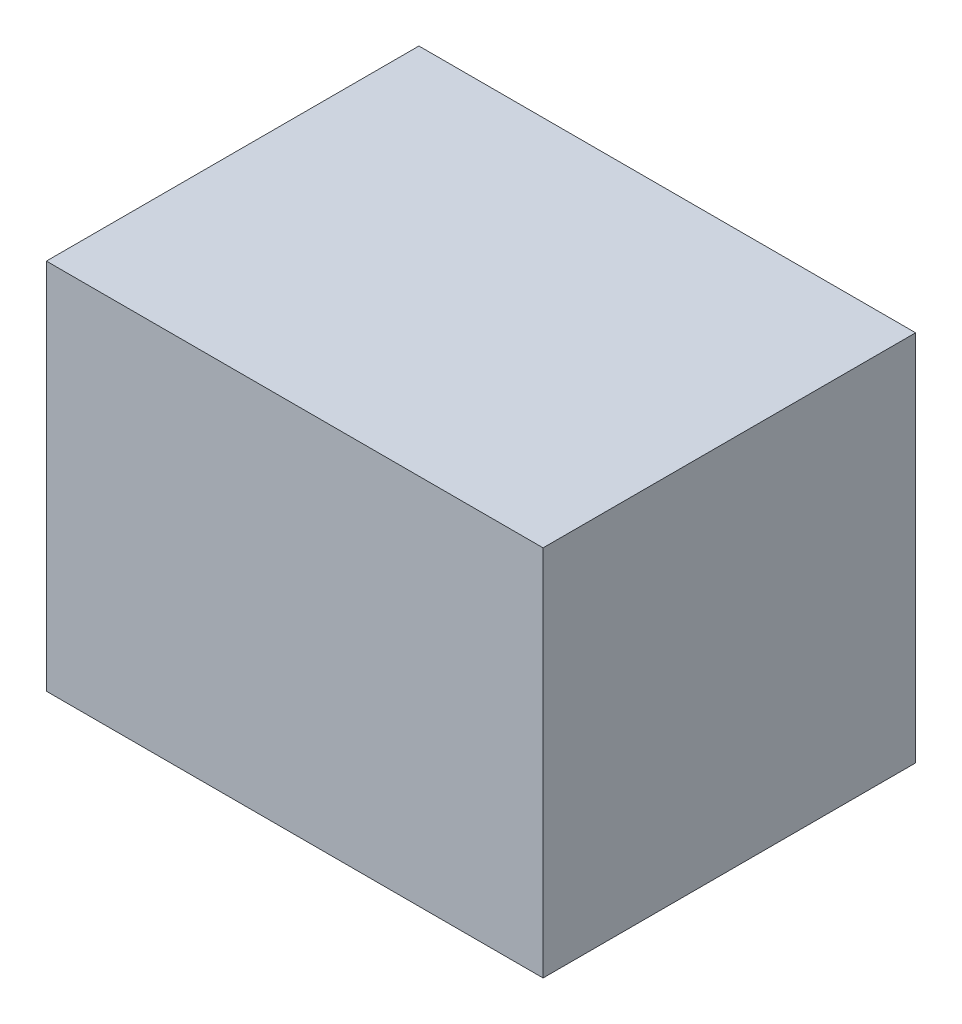
ISO-10303-21;
HEADER;
FILE_DESCRIPTION(('STEP AP214'),'2;1');
FILE_NAME('part.step','',(''),(''),'','','');
FILE_SCHEMA(('AUTOMOTIVE_DESIGN { 1 0 10303 214 1 1 1 1 }'));
ENDSEC;
DATA;
#1=APPLICATION_CONTEXT('core data for automotive mechanical design processes');
#2=APPLICATION_PROTOCOL_DEFINITION('international standard','automotive_design',2000,#1);
#3=PRODUCT_CONTEXT('',#1,'mechanical');
#4=PRODUCT('Part','Part','',(#3));
#5=PRODUCT_RELATED_PRODUCT_CATEGORY('part','',(#4));
#6=PRODUCT_DEFINITION_FORMATION('','',#4);
#7=PRODUCT_DEFINITION_CONTEXT('part definition',#1,'design');
#8=PRODUCT_DEFINITION('design','',#6,#7);
#9=PRODUCT_DEFINITION_SHAPE('','',#8);
#10=(LENGTH_UNIT() NAMED_UNIT(*) SI_UNIT(.MILLI.,.METRE.));
#11=(NAMED_UNIT(*) PLANE_ANGLE_UNIT() SI_UNIT($,.RADIAN.));
#12=(NAMED_UNIT(*) SI_UNIT($,.STERADIAN.) SOLID_ANGLE_UNIT());
#13=UNCERTAINTY_MEASURE_WITH_UNIT(LENGTH_MEASURE(1.E-05),#10,'distance_accuracy_value','');
#14=(GEOMETRIC_REPRESENTATION_CONTEXT(3) GLOBAL_UNCERTAINTY_ASSIGNED_CONTEXT((#13)) GLOBAL_UNIT_ASSIGNED_CONTEXT((#10,
#11,#12)) REPRESENTATION_CONTEXT('',''));
#15=CARTESIAN_POINT('',(0.,0.,0.));
#16=DIRECTION('',(0.,0.,1.));
#17=DIRECTION('',(1.,0.,0.));
#18=AXIS2_PLACEMENT_3D('',#15,#16,#17);
#19=CARTESIAN_POINT('',(1.20000014,0.90000074,0.));
#20=DIRECTION('',(0.,-1.,0.));
#21=DIRECTION('',(0.,0.,-1.));
#22=AXIS2_PLACEMENT_3D('',#19,#20,#21);
#23=PLANE('',#22);
#24=DIRECTION('',(0.,0.,-1.));
#25=VECTOR('',#24,1.);
#26=CARTESIAN_POINT('',(-1.20000014,0.90000074,0.));
#27=LINE('',#26,#25);
#28=CARTESIAN_POINT('',(-1.20000014,0.90000074,0.));
#29=VERTEX_POINT('',#28);
#30=CARTESIAN_POINT('',(-1.20000014,0.90000074,1.79999894));
#31=VERTEX_POINT('',#30);
#32=EDGE_CURVE('E19',#29,#31,#27,.F.);
#33=ORIENTED_EDGE('',*,*,#32,.T.);
#34=DIRECTION('',(-1.,0.,0.));
#35=VECTOR('',#34,1.);
#36=CARTESIAN_POINT('',(-1.20000014,0.90000074,1.79999894));
#37=LINE('',#36,#35);
#38=CARTESIAN_POINT('',(1.20000014,0.90000074,1.79999894));
#39=VERTEX_POINT('',#38);
#40=EDGE_CURVE('E54',#31,#39,#37,.F.);
#41=ORIENTED_EDGE('',*,*,#40,.T.);
#42=DIRECTION('',(0.,0.,1.));
#43=VECTOR('',#42,1.);
#44=CARTESIAN_POINT('',(1.20000014,0.90000074,0.));
#45=LINE('',#44,#43);
#46=CARTESIAN_POINT('',(1.20000014,0.90000074,0.));
#47=VERTEX_POINT('',#46);
#48=EDGE_CURVE('E73',#39,#47,#45,.F.);
#49=ORIENTED_EDGE('',*,*,#48,.T.);
#50=DIRECTION('',(-1.,0.,0.));
#51=VECTOR('',#50,1.);
#52=CARTESIAN_POINT('',(-1.20000014,0.90000074,0.));
#53=LINE('',#52,#51);
#54=EDGE_CURVE('E65',#29,#47,#53,.F.);
#55=ORIENTED_EDGE('',*,*,#54,.F.);
#56=EDGE_LOOP('',(#33,#41,#49,#55));
#57=FACE_BOUND('',#56,.T.);
#58=ADVANCED_FACE('F16',(#57),#23,.F.);
#59=CARTESIAN_POINT('',(-1.20000014,0.90000074,0.));
#60=DIRECTION('',(1.,0.,0.));
#61=DIRECTION('',(0.,0.,-1.));
#62=AXIS2_PLACEMENT_3D('',#59,#60,#61);
#63=PLANE('',#62);
#64=DIRECTION('',(0.,0.,1.));
#65=VECTOR('',#64,1.);
#66=CARTESIAN_POINT('',(-1.20000014,-0.8999982,0.));
#67=LINE('',#66,#65);
#68=CARTESIAN_POINT('',(-1.20000014,-0.8999982,0.));
#69=VERTEX_POINT('',#68);
#70=CARTESIAN_POINT('',(-1.20000014,-0.8999982,1.79999894));
#71=VERTEX_POINT('',#70);
#72=EDGE_CURVE('E71',#69,#71,#67,.T.);
#73=ORIENTED_EDGE('',*,*,#72,.T.);
#74=DIRECTION('',(0.,1.,0.));
#75=VECTOR('',#74,1.);
#76=CARTESIAN_POINT('',(-1.20000014,0.90000074,1.79999894));
#77=LINE('',#76,#75);
#78=EDGE_CURVE('E61',#71,#31,#77,.T.);
#79=ORIENTED_EDGE('',*,*,#78,.T.);
#80=ORIENTED_EDGE('',*,*,#32,.F.);
#81=DIRECTION('',(0.,1.,0.));
#82=VECTOR('',#81,1.);
#83=CARTESIAN_POINT('',(-1.20000014,0.90000074,0.));
#84=LINE('',#83,#82);
#85=EDGE_CURVE('E79',#69,#29,#84,.T.);
#86=ORIENTED_EDGE('',*,*,#85,.F.);
#87=EDGE_LOOP('',(#73,#79,#80,#86));
#88=FACE_BOUND('',#87,.T.);
#89=ADVANCED_FACE('F70',(#88),#63,.F.);
#90=CARTESIAN_POINT('',(-1.20000014,0.90000074,1.79999894));
#91=DIRECTION('',(0.,0.,-1.));
#92=DIRECTION('',(-1.,0.,0.));
#93=AXIS2_PLACEMENT_3D('',#90,#91,#92);
#94=PLANE('',#93);
#95=DIRECTION('',(1.,0.,0.));
#96=VECTOR('',#95,1.);
#97=CARTESIAN_POINT('',(-1.20000014,-0.8999982,1.79999894));
#98=LINE('',#97,#96);
#99=CARTESIAN_POINT('',(1.20000014,-0.8999982,1.79999894));
#100=VERTEX_POINT('',#99);
#101=EDGE_CURVE('E82',#71,#100,#98,.T.);
#102=ORIENTED_EDGE('',*,*,#101,.T.);
#103=DIRECTION('',(0.,1.,0.));
#104=VECTOR('',#103,1.);
#105=CARTESIAN_POINT('',(1.20000014,-0.8999982,1.79999894));
#106=LINE('',#105,#104);
#107=EDGE_CURVE('E63',#100,#39,#106,.T.);
#108=ORIENTED_EDGE('',*,*,#107,.T.);
#109=ORIENTED_EDGE('',*,*,#40,.F.);
#110=ORIENTED_EDGE('',*,*,#78,.F.);
#111=EDGE_LOOP('',(#102,#108,#109,#110));
#112=FACE_BOUND('',#111,.T.);
#113=ADVANCED_FACE('F59',(#112),#94,.F.);
#114=CARTESIAN_POINT('',(1.20000014,-0.8999982,0.));
#115=DIRECTION('',(-1.,0.,0.));
#116=DIRECTION('',(0.,0.,1.));
#117=AXIS2_PLACEMENT_3D('',#114,#115,#116);
#118=PLANE('',#117);
#119=ORIENTED_EDGE('',*,*,#48,.F.);
#120=ORIENTED_EDGE('',*,*,#107,.F.);
#121=DIRECTION('',(0.,0.,1.));
#122=VECTOR('',#121,1.);
#123=CARTESIAN_POINT('',(1.20000014,-0.8999982,0.));
#124=LINE('',#123,#122);
#125=CARTESIAN_POINT('',(1.20000014,-0.8999982,0.));
#126=VERTEX_POINT('',#125);
#127=EDGE_CURVE('E25',#100,#126,#124,.F.);
#128=ORIENTED_EDGE('',*,*,#127,.T.);
#129=DIRECTION('',(0.,1.,0.));
#130=VECTOR('',#129,1.);
#131=CARTESIAN_POINT('',(1.20000014,0.90000074,0.));
#132=LINE('',#131,#130);
#133=EDGE_CURVE('E33',#47,#126,#132,.F.);
#134=ORIENTED_EDGE('',*,*,#133,.F.);
#135=EDGE_LOOP('',(#119,#120,#128,#134));
#136=FACE_BOUND('',#135,.T.);
#137=ADVANCED_FACE('F87',(#136),#118,.F.);
#138=CARTESIAN_POINT('',(-1.20000014,0.90000074,0.));
#139=DIRECTION('',(0.,0.,-1.));
#140=DIRECTION('',(-1.,0.,0.));
#141=AXIS2_PLACEMENT_3D('',#138,#139,#140);
#142=PLANE('',#141);
#143=DIRECTION('',(1.,0.,0.));
#144=VECTOR('',#143,1.);
#145=CARTESIAN_POINT('',(-1.20000014,-0.8999982,0.));
#146=LINE('',#145,#144);
#147=EDGE_CURVE('E11',#126,#69,#146,.F.);
#148=ORIENTED_EDGE('',*,*,#147,.T.);
#149=ORIENTED_EDGE('',*,*,#85,.T.);
#150=ORIENTED_EDGE('',*,*,#54,.T.);
#151=ORIENTED_EDGE('',*,*,#133,.T.);
#152=EDGE_LOOP('',(#148,#149,#150,#151));
#153=FACE_BOUND('',#152,.T.);
#154=ADVANCED_FACE('F90',(#153),#142,.T.);
#155=CARTESIAN_POINT('',(-1.20000014,-0.8999982,0.));
#156=DIRECTION('',(0.,1.,0.));
#157=DIRECTION('',(0.,0.,1.));
#158=AXIS2_PLACEMENT_3D('',#155,#156,#157);
#159=PLANE('',#158);
#160=ORIENTED_EDGE('',*,*,#127,.F.);
#161=ORIENTED_EDGE('',*,*,#101,.F.);
#162=ORIENTED_EDGE('',*,*,#72,.F.);
#163=ORIENTED_EDGE('',*,*,#147,.F.);
#164=EDGE_LOOP('',(#160,#161,#162,#163));
#165=FACE_BOUND('',#164,.T.);
#166=ADVANCED_FACE('F89',(#165),#159,.F.);
#167=CLOSED_SHELL('',(#58,#89,#113,#137,#154,#166));
#168=MANIFOLD_SOLID_BREP('B1',#167);
#169=ADVANCED_BREP_SHAPE_REPRESENTATION('',(#18,#168),#14);
#170=SHAPE_DEFINITION_REPRESENTATION(#9,#169);
ENDSEC;
END-ISO-10303-21;
